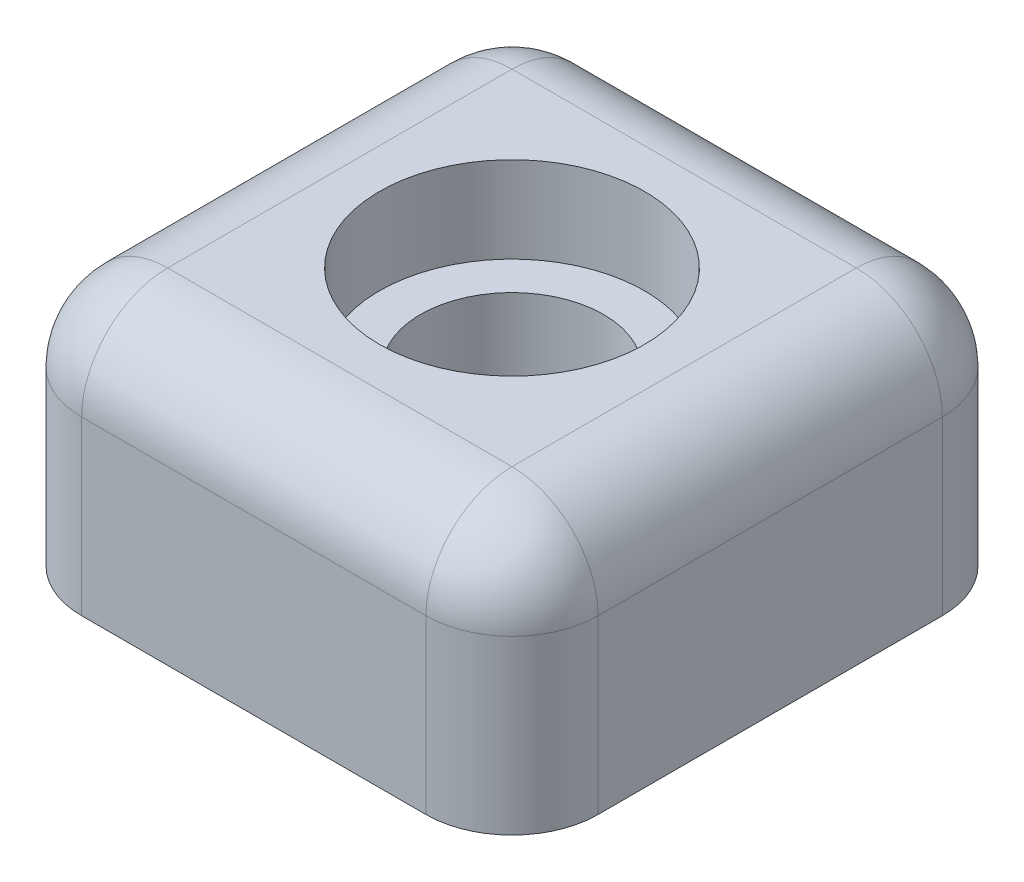
ISO-10303-21;
HEADER;
FILE_DESCRIPTION(('STEP AP214'),'2;1');
FILE_NAME('part.step','',(''),(''),'','','');
FILE_SCHEMA(('AUTOMOTIVE_DESIGN { 1 0 10303 214 1 1 1 1 }'));
ENDSEC;
DATA;
#1=APPLICATION_CONTEXT('core data for automotive mechanical design processes');
#2=APPLICATION_PROTOCOL_DEFINITION('international standard','automotive_design',2000,#1);
#3=PRODUCT_CONTEXT('',#1,'mechanical');
#4=PRODUCT('Part','Part','',(#3));
#5=PRODUCT_RELATED_PRODUCT_CATEGORY('part','',(#4));
#6=PRODUCT_DEFINITION_FORMATION('','',#4);
#7=PRODUCT_DEFINITION_CONTEXT('part definition',#1,'design');
#8=PRODUCT_DEFINITION('design','',#6,#7);
#9=PRODUCT_DEFINITION_SHAPE('','',#8);
#10=(LENGTH_UNIT() NAMED_UNIT(*) SI_UNIT(.MILLI.,.METRE.));
#11=(NAMED_UNIT(*) PLANE_ANGLE_UNIT() SI_UNIT($,.RADIAN.));
#12=(NAMED_UNIT(*) SI_UNIT($,.STERADIAN.) SOLID_ANGLE_UNIT());
#13=UNCERTAINTY_MEASURE_WITH_UNIT(LENGTH_MEASURE(1.E-05),#10,'distance_accuracy_value','');
#14=(GEOMETRIC_REPRESENTATION_CONTEXT(3) GLOBAL_UNCERTAINTY_ASSIGNED_CONTEXT((#13)) GLOBAL_UNIT_ASSIGNED_CONTEXT((#10,
#11,#12)) REPRESENTATION_CONTEXT('',''));
#15=CARTESIAN_POINT('',(0.,0.,0.));
#16=DIRECTION('',(0.,0.,1.));
#17=DIRECTION('',(1.,0.,0.));
#18=AXIS2_PLACEMENT_3D('',#15,#16,#17);
#19=CARTESIAN_POINT('',(0.,3.175,0.));
#20=DIRECTION('',(0.,-1.,0.));
#21=DIRECTION('',(0.,0.,-1.));
#22=AXIS2_PLACEMENT_3D('',#19,#20,#21);
#23=PLANE('',#22);
#24=DIRECTION('',(1.,0.,0.));
#25=VECTOR('',#24,1.);
#26=CARTESIAN_POINT('',(0.,3.175,6.35));
#27=LINE('',#26,#25);
#28=CARTESIAN_POINT('',(-6.35,3.175,6.35));
#29=VERTEX_POINT('',#28);
#30=CARTESIAN_POINT('',(6.35,3.175,6.35));
#31=VERTEX_POINT('',#30);
#32=EDGE_CURVE('E114',#29,#31,#27,.T.);
#33=ORIENTED_EDGE('',*,*,#32,.T.);
#34=DIRECTION('',(0.,0.,-1.));
#35=VECTOR('',#34,1.);
#36=CARTESIAN_POINT('',(6.35,3.175,0.));
#37=LINE('',#36,#35);
#38=CARTESIAN_POINT('',(6.35,3.175,-6.35));
#39=VERTEX_POINT('',#38);
#40=EDGE_CURVE('E151',#31,#39,#37,.T.);
#41=ORIENTED_EDGE('',*,*,#40,.T.);
#42=DIRECTION('',(-1.,0.,0.));
#43=VECTOR('',#42,1.);
#44=CARTESIAN_POINT('',(0.,3.175,-6.35));
#45=LINE('',#44,#43);
#46=CARTESIAN_POINT('',(-6.35,3.175,-6.35));
#47=VERTEX_POINT('',#46);
#48=EDGE_CURVE('E117',#39,#47,#45,.T.);
#49=ORIENTED_EDGE('',*,*,#48,.T.);
#50=DIRECTION('',(0.,0.,1.));
#51=VECTOR('',#50,1.);
#52=CARTESIAN_POINT('',(-6.35,3.175,0.));
#53=LINE('',#52,#51);
#54=EDGE_CURVE('E109',#47,#29,#53,.T.);
#55=ORIENTED_EDGE('',*,*,#54,.T.);
#56=EDGE_LOOP('',(#33,#41,#49,#55));
#57=FACE_BOUND('',#56,.T.);
#58=CARTESIAN_POINT('',(0.,3.175,0.));
#59=DIRECTION('',(0.,1.,0.));
#60=DIRECTION('',(0.,0.,1.));
#61=AXIS2_PLACEMENT_3D('',#58,#59,#60);
#62=CIRCLE('',#61,4.8895);
#63=CARTESIAN_POINT('',(0.,3.175,4.8895));
#64=VERTEX_POINT('',#63);
#65=EDGE_CURVE('E143',#64,#64,#62,.T.);
#66=ORIENTED_EDGE('',*,*,#65,.F.);
#67=EDGE_LOOP('',(#66));
#68=FACE_BOUND('',#67,.T.);
#69=ADVANCED_FACE('F33',(#57,#68),#23,.F.);
#70=CARTESIAN_POINT('',(9.525,3.175,9.525));
#71=DIRECTION('',(-1.,0.,0.));
#72=DIRECTION('',(0.,0.,1.));
#73=AXIS2_PLACEMENT_3D('',#70,#71,#72);
#74=PLANE('',#73);
#75=DIRECTION('',(0.,0.,1.));
#76=VECTOR('',#75,1.);
#77=CARTESIAN_POINT('',(9.525,-6.35,-9.525));
#78=LINE('',#77,#76);
#79=CARTESIAN_POINT('',(9.525,-6.35,-6.35));
#80=VERTEX_POINT('',#79);
#81=CARTESIAN_POINT('',(9.525,-6.35,6.34999999999999));
#82=VERTEX_POINT('',#81);
#83=EDGE_CURVE('E223',#80,#82,#78,.T.);
#84=ORIENTED_EDGE('',*,*,#83,.F.);
#85=DIRECTION('',(0.,-1.,0.));
#86=VECTOR('',#85,1.);
#87=CARTESIAN_POINT('',(9.525,3.175,-6.35));
#88=LINE('',#87,#86);
#89=CARTESIAN_POINT('',(9.525,0.,-6.35));
#90=VERTEX_POINT('',#89);
#91=EDGE_CURVE('E158',#80,#90,#88,.F.);
#92=ORIENTED_EDGE('',*,*,#91,.T.);
#93=DIRECTION('',(0.,0.,-1.));
#94=VECTOR('',#93,1.);
#95=CARTESIAN_POINT('',(9.525,0.,9.525));
#96=LINE('',#95,#94);
#97=CARTESIAN_POINT('',(9.525,0.,6.35));
#98=VERTEX_POINT('',#97);
#99=EDGE_CURVE('E155',#90,#98,#96,.F.);
#100=ORIENTED_EDGE('',*,*,#99,.T.);
#101=DIRECTION('',(0.,-1.,0.));
#102=VECTOR('',#101,1.);
#103=CARTESIAN_POINT('',(9.525,3.175,6.35));
#104=LINE('',#103,#102);
#105=EDGE_CURVE('E153',#98,#82,#104,.T.);
#106=ORIENTED_EDGE('',*,*,#105,.T.);
#107=EDGE_LOOP('',(#84,#92,#100,#106));
#108=FACE_BOUND('',#107,.T.);
#109=ADVANCED_FACE('F227',(#108),#74,.F.);
#110=CARTESIAN_POINT('',(-9.525,3.175,-9.525));
#111=DIRECTION('',(0.,0.,1.));
#112=DIRECTION('',(1.,0.,0.));
#113=AXIS2_PLACEMENT_3D('',#110,#111,#112);
#114=PLANE('',#113);
#115=DIRECTION('',(1.,0.,0.));
#116=VECTOR('',#115,1.);
#117=CARTESIAN_POINT('',(-9.525,-6.35,-9.525));
#118=LINE('',#117,#116);
#119=CARTESIAN_POINT('',(-6.35,-6.35,-9.525));
#120=VERTEX_POINT('',#119);
#121=CARTESIAN_POINT('',(6.34999999999999,-6.35,-9.525));
#122=VERTEX_POINT('',#121);
#123=EDGE_CURVE('E225',#120,#122,#118,.T.);
#124=ORIENTED_EDGE('',*,*,#123,.F.);
#125=DIRECTION('',(0.,-1.,0.));
#126=VECTOR('',#125,1.);
#127=CARTESIAN_POINT('',(-6.35,3.175,-9.525));
#128=LINE('',#127,#126);
#129=CARTESIAN_POINT('',(-6.35,0.,-9.525));
#130=VERTEX_POINT('',#129);
#131=EDGE_CURVE('E164',#120,#130,#128,.F.);
#132=ORIENTED_EDGE('',*,*,#131,.T.);
#133=DIRECTION('',(-1.,0.,0.));
#134=VECTOR('',#133,1.);
#135=CARTESIAN_POINT('',(-9.525,0.,-9.525));
#136=LINE('',#135,#134);
#137=CARTESIAN_POINT('',(6.35,0.,-9.525));
#138=VERTEX_POINT('',#137);
#139=EDGE_CURVE('E162',#130,#138,#136,.F.);
#140=ORIENTED_EDGE('',*,*,#139,.T.);
#141=DIRECTION('',(0.,-1.,0.));
#142=VECTOR('',#141,1.);
#143=CARTESIAN_POINT('',(6.35,3.175,-9.525));
#144=LINE('',#143,#142);
#145=EDGE_CURVE('E160',#138,#122,#144,.T.);
#146=ORIENTED_EDGE('',*,*,#145,.T.);
#147=EDGE_LOOP('',(#124,#132,#140,#146));
#148=FACE_BOUND('',#147,.T.);
#149=ADVANCED_FACE('F209',(#148),#114,.F.);
#150=CARTESIAN_POINT('',(-9.525,3.175,9.525));
#151=DIRECTION('',(1.,0.,0.));
#152=DIRECTION('',(0.,0.,-1.));
#153=AXIS2_PLACEMENT_3D('',#150,#151,#152);
#154=PLANE('',#153);
#155=DIRECTION('',(0.,0.,1.));
#156=VECTOR('',#155,1.);
#157=CARTESIAN_POINT('',(-9.525,0.,9.525));
#158=LINE('',#157,#156);
#159=CARTESIAN_POINT('',(-9.525,0.,6.35));
#160=VERTEX_POINT('',#159);
#161=CARTESIAN_POINT('',(-9.525,0.,-6.35));
#162=VERTEX_POINT('',#161);
#163=EDGE_CURVE('E127',#160,#162,#158,.F.);
#164=ORIENTED_EDGE('',*,*,#163,.T.);
#165=DIRECTION('',(0.,-1.,0.));
#166=VECTOR('',#165,1.);
#167=CARTESIAN_POINT('',(-9.525,3.175,-6.35));
#168=LINE('',#167,#166);
#169=CARTESIAN_POINT('',(-9.525,-6.35,-6.34999999999999));
#170=VERTEX_POINT('',#169);
#171=EDGE_CURVE('E169',#162,#170,#168,.T.);
#172=ORIENTED_EDGE('',*,*,#171,.T.);
#173=DIRECTION('',(0.,0.,-1.));
#174=VECTOR('',#173,1.);
#175=CARTESIAN_POINT('',(-9.525,-6.35,9.525));
#176=LINE('',#175,#174);
#177=CARTESIAN_POINT('',(-9.525,-6.35,6.35));
#178=VERTEX_POINT('',#177);
#179=EDGE_CURVE('E234',#178,#170,#176,.T.);
#180=ORIENTED_EDGE('',*,*,#179,.F.);
#181=DIRECTION('',(0.,-1.,0.));
#182=VECTOR('',#181,1.);
#183=CARTESIAN_POINT('',(-9.525,3.175,6.35));
#184=LINE('',#183,#182);
#185=EDGE_CURVE('E166',#178,#160,#184,.F.);
#186=ORIENTED_EDGE('',*,*,#185,.T.);
#187=EDGE_LOOP('',(#164,#172,#180,#186));
#188=FACE_BOUND('',#187,.T.);
#189=ADVANCED_FACE('F261',(#188),#154,.F.);
#190=CARTESIAN_POINT('',(-9.525,3.175,9.525));
#191=DIRECTION('',(0.,0.,-1.));
#192=DIRECTION('',(-1.,0.,0.));
#193=AXIS2_PLACEMENT_3D('',#190,#191,#192);
#194=PLANE('',#193);
#195=DIRECTION('',(-1.,0.,0.));
#196=VECTOR('',#195,1.);
#197=CARTESIAN_POINT('',(9.525,-6.35,9.525));
#198=LINE('',#197,#196);
#199=CARTESIAN_POINT('',(6.35,-6.35,9.525));
#200=VERTEX_POINT('',#199);
#201=CARTESIAN_POINT('',(-6.35,-6.35,9.525));
#202=VERTEX_POINT('',#201);
#203=EDGE_CURVE('E229',#200,#202,#198,.T.);
#204=ORIENTED_EDGE('',*,*,#203,.F.);
#205=DIRECTION('',(0.,-1.,0.));
#206=VECTOR('',#205,1.);
#207=CARTESIAN_POINT('',(6.35,3.175,9.525));
#208=LINE('',#207,#206);
#209=CARTESIAN_POINT('',(6.35,0.,9.525));
#210=VERTEX_POINT('',#209);
#211=EDGE_CURVE('E50',#200,#210,#208,.F.);
#212=ORIENTED_EDGE('',*,*,#211,.T.);
#213=DIRECTION('',(1.,0.,0.));
#214=VECTOR('',#213,1.);
#215=CARTESIAN_POINT('',(-9.525,0.,9.525));
#216=LINE('',#215,#214);
#217=CARTESIAN_POINT('',(-6.35,0.,9.525));
#218=VERTEX_POINT('',#217);
#219=EDGE_CURVE('E54',#210,#218,#216,.F.);
#220=ORIENTED_EDGE('',*,*,#219,.T.);
#221=DIRECTION('',(0.,-1.,0.));
#222=VECTOR('',#221,1.);
#223=CARTESIAN_POINT('',(-6.35,3.175,9.525));
#224=LINE('',#223,#222);
#225=EDGE_CURVE('E171',#218,#202,#224,.T.);
#226=ORIENTED_EDGE('',*,*,#225,.T.);
#227=EDGE_LOOP('',(#204,#212,#220,#226));
#228=FACE_BOUND('',#227,.T.);
#229=ADVANCED_FACE('F251',(#228),#194,.F.);
#230=CARTESIAN_POINT('',(0.,3.175,0.));
#231=DIRECTION('',(0.,-1.,0.));
#232=DIRECTION('',(0.,0.,-1.));
#233=AXIS2_PLACEMENT_3D('',#230,#231,#232);
#234=CYLINDRICAL_SURFACE('',#233,4.8895);
#235=ORIENTED_EDGE('',*,*,#65,.T.);
#236=EDGE_LOOP('',(#235));
#237=FACE_BOUND('',#236,.T.);
#238=CARTESIAN_POINT('',(0.,0.,0.));
#239=DIRECTION('',(0.,1.,0.));
#240=DIRECTION('',(0.,0.,1.));
#241=AXIS2_PLACEMENT_3D('',#238,#239,#240);
#242=CIRCLE('',#241,4.8895);
#243=CARTESIAN_POINT('',(0.,0.,4.8895));
#244=VERTEX_POINT('',#243);
#245=EDGE_CURVE('E146',#244,#244,#242,.T.);
#246=ORIENTED_EDGE('',*,*,#245,.F.);
#247=EDGE_LOOP('',(#246));
#248=FACE_BOUND('',#247,.T.);
#249=ADVANCED_FACE('F249',(#237,#248),#234,.F.);
#250=CARTESIAN_POINT('',(0.,0.,0.));
#251=DIRECTION('',(0.,-1.,0.));
#252=DIRECTION('',(0.,0.,-1.));
#253=AXIS2_PLACEMENT_3D('',#250,#251,#252);
#254=PLANE('',#253);
#255=CARTESIAN_POINT('',(0.,0.,0.));
#256=DIRECTION('',(0.,-1.,0.));
#257=DIRECTION('',(0.,0.,-1.));
#258=AXIS2_PLACEMENT_3D('',#255,#256,#257);
#259=CIRCLE('',#258,3.3782);
#260=CARTESIAN_POINT('',(0.,0.,-3.3782));
#261=VERTEX_POINT('',#260);
#262=EDGE_CURVE('E240',#261,#261,#259,.T.);
#263=ORIENTED_EDGE('',*,*,#262,.T.);
#264=EDGE_LOOP('',(#263));
#265=FACE_BOUND('',#264,.T.);
#266=ORIENTED_EDGE('',*,*,#245,.T.);
#267=EDGE_LOOP('',(#266));
#268=FACE_BOUND('',#267,.T.);
#269=ADVANCED_FACE('F247',(#265,#268),#254,.F.);
#270=CARTESIAN_POINT('',(0.,-3.175,0.));
#271=DIRECTION('',(0.,1.,0.));
#272=DIRECTION('',(0.,0.,1.));
#273=AXIS2_PLACEMENT_3D('',#270,#271,#272);
#274=CYLINDRICAL_SURFACE('',#273,3.3782);
#275=CARTESIAN_POINT('',(0.,-3.175,0.));
#276=DIRECTION('',(0.,-1.,0.));
#277=DIRECTION('',(0.,0.,-1.));
#278=AXIS2_PLACEMENT_3D('',#275,#276,#277);
#279=CIRCLE('',#278,3.3782);
#280=CARTESIAN_POINT('',(0.,-3.175,-3.3782));
#281=VERTEX_POINT('',#280);
#282=EDGE_CURVE('E232',#281,#281,#279,.T.);
#283=ORIENTED_EDGE('',*,*,#282,.T.);
#284=EDGE_LOOP('',(#283));
#285=FACE_BOUND('',#284,.T.);
#286=ORIENTED_EDGE('',*,*,#262,.F.);
#287=EDGE_LOOP('',(#286));
#288=FACE_BOUND('',#287,.T.);
#289=ADVANCED_FACE('F258',(#285,#288),#274,.F.);
#290=CARTESIAN_POINT('',(0.,-3.175,0.));
#291=DIRECTION('',(0.,-1.,0.));
#292=DIRECTION('',(0.,0.,-1.));
#293=AXIS2_PLACEMENT_3D('',#290,#291,#292);
#294=PLANE('',#293);
#295=ORIENTED_EDGE('',*,*,#282,.F.);
#296=EDGE_LOOP('',(#295));
#297=FACE_BOUND('',#296,.T.);
#298=ADVANCED_FACE('F314',(#297),#294,.F.);
#299=CARTESIAN_POINT('',(0.,-6.35,0.));
#300=DIRECTION('',(0.,-1.,0.));
#301=DIRECTION('',(0.,0.,-1.));
#302=AXIS2_PLACEMENT_3D('',#299,#300,#301);
#303=PLANE('',#302);
#304=ORIENTED_EDGE('',*,*,#179,.T.);
#305=CARTESIAN_POINT('',(-6.35,-6.35,-6.35));
#306=DIRECTION('',(0.,-1.,0.));
#307=DIRECTION('',(0.,0.,-1.));
#308=AXIS2_PLACEMENT_3D('',#305,#306,#307);
#309=CIRCLE('',#308,3.175);
#310=EDGE_CURVE('E11',#170,#120,#309,.T.);
#311=ORIENTED_EDGE('',*,*,#310,.T.);
#312=ORIENTED_EDGE('',*,*,#123,.T.);
#313=CARTESIAN_POINT('',(6.35,-6.35,-6.35));
#314=DIRECTION('',(0.,-1.,0.));
#315=DIRECTION('',(0.,0.,-1.));
#316=AXIS2_PLACEMENT_3D('',#313,#314,#315);
#317=CIRCLE('',#316,3.175);
#318=EDGE_CURVE('E42',#122,#80,#317,.T.);
#319=ORIENTED_EDGE('',*,*,#318,.T.);
#320=ORIENTED_EDGE('',*,*,#83,.T.);
#321=CARTESIAN_POINT('',(6.35,-6.35,6.35));
#322=DIRECTION('',(0.,-1.,0.));
#323=DIRECTION('',(0.,0.,-1.));
#324=AXIS2_PLACEMENT_3D('',#321,#322,#323);
#325=CIRCLE('',#324,3.175);
#326=EDGE_CURVE('E177',#82,#200,#325,.T.);
#327=ORIENTED_EDGE('',*,*,#326,.T.);
#328=ORIENTED_EDGE('',*,*,#203,.T.);
#329=CARTESIAN_POINT('',(-6.35,-6.35,6.35));
#330=DIRECTION('',(0.,-1.,0.));
#331=DIRECTION('',(0.,0.,-1.));
#332=AXIS2_PLACEMENT_3D('',#329,#330,#331);
#333=CIRCLE('',#332,3.175);
#334=EDGE_CURVE('E175',#202,#178,#333,.T.);
#335=ORIENTED_EDGE('',*,*,#334,.T.);
#336=EDGE_LOOP('',(#304,#311,#312,#319,#320,#327,#328,#335));
#337=FACE_BOUND('',#336,.T.);
#338=ADVANCED_FACE('F222',(#337),#303,.T.);
#339=CARTESIAN_POINT('',(-6.35,3.175,6.35));
#340=DIRECTION('',(0.,-1.,0.));
#341=DIRECTION('',(0.,0.,-1.));
#342=AXIS2_PLACEMENT_3D('',#339,#340,#341);
#343=CYLINDRICAL_SURFACE('',#342,3.175);
#344=ORIENTED_EDGE('',*,*,#334,.F.);
#345=ORIENTED_EDGE('',*,*,#225,.F.);
#346=CARTESIAN_POINT('',(-6.35,0.,6.35));
#347=DIRECTION('',(0.,1.,0.));
#348=DIRECTION('',(0.,0.,1.));
#349=AXIS2_PLACEMENT_3D('',#346,#347,#348);
#350=CIRCLE('',#349,3.175);
#351=EDGE_CURVE('E37',#160,#218,#350,.T.);
#352=ORIENTED_EDGE('',*,*,#351,.F.);
#353=ORIENTED_EDGE('',*,*,#185,.F.);
#354=EDGE_LOOP('',(#344,#345,#352,#353));
#355=FACE_BOUND('',#354,.T.);
#356=ADVANCED_FACE('F35',(#355),#343,.T.);
#357=CARTESIAN_POINT('',(-6.35,0.,0.));
#358=DIRECTION('',(0.,0.,1.));
#359=DIRECTION('',(1.,0.,0.));
#360=AXIS2_PLACEMENT_3D('',#357,#358,#359);
#361=CYLINDRICAL_SURFACE('',#360,3.175);
#362=CARTESIAN_POINT('',(-6.35,0.,-6.35));
#363=DIRECTION('',(0.,0.,-1.));
#364=DIRECTION('',(0.,1.,0.));
#365=AXIS2_PLACEMENT_3D('',#362,#363,#364);
#366=CIRCLE('',#365,3.175);
#367=EDGE_CURVE('E131',#162,#47,#366,.T.);
#368=ORIENTED_EDGE('',*,*,#367,.F.);
#369=ORIENTED_EDGE('',*,*,#163,.F.);
#370=CARTESIAN_POINT('',(-6.35,0.,6.35));
#371=DIRECTION('',(0.,0.,1.));
#372=DIRECTION('',(1.,0.,0.));
#373=AXIS2_PLACEMENT_3D('',#370,#371,#372);
#374=CIRCLE('',#373,3.175);
#375=EDGE_CURVE('E124',#29,#160,#374,.T.);
#376=ORIENTED_EDGE('',*,*,#375,.F.);
#377=ORIENTED_EDGE('',*,*,#54,.F.);
#378=EDGE_LOOP('',(#368,#369,#376,#377));
#379=FACE_BOUND('',#378,.T.);
#380=ADVANCED_FACE('F126',(#379),#361,.T.);
#381=CARTESIAN_POINT('',(-6.35,3.175,-6.35));
#382=DIRECTION('',(0.,-1.,0.));
#383=DIRECTION('',(0.,0.,-1.));
#384=AXIS2_PLACEMENT_3D('',#381,#382,#383);
#385=CYLINDRICAL_SURFACE('',#384,3.175);
#386=ORIENTED_EDGE('',*,*,#310,.F.);
#387=ORIENTED_EDGE('',*,*,#171,.F.);
#388=CARTESIAN_POINT('',(-6.35,0.,-6.35));
#389=DIRECTION('',(0.,1.,0.));
#390=DIRECTION('',(0.,0.,1.));
#391=AXIS2_PLACEMENT_3D('',#388,#389,#390);
#392=CIRCLE('',#391,3.175);
#393=EDGE_CURVE('E136',#130,#162,#392,.T.);
#394=ORIENTED_EDGE('',*,*,#393,.F.);
#395=ORIENTED_EDGE('',*,*,#131,.F.);
#396=EDGE_LOOP('',(#386,#387,#394,#395));
#397=FACE_BOUND('',#396,.T.);
#398=ADVANCED_FACE('F302',(#397),#385,.T.);
#399=CARTESIAN_POINT('',(-6.35,0.,6.35));
#400=DIRECTION('',(0.,0.,1.));
#401=DIRECTION('',(1.,0.,0.));
#402=AXIS2_PLACEMENT_3D('',#399,#400,#401);
#403=SPHERICAL_SURFACE('',#402,3.175);
#404=ORIENTED_EDGE('',*,*,#375,.T.);
#405=ORIENTED_EDGE('',*,*,#351,.T.);
#406=CARTESIAN_POINT('',(-6.35,0.,6.35));
#407=DIRECTION('',(-1.,0.,0.));
#408=DIRECTION('',(0.,0.,1.));
#409=AXIS2_PLACEMENT_3D('',#406,#407,#408);
#410=CIRCLE('',#409,3.175);
#411=EDGE_CURVE('E133',#29,#218,#410,.F.);
#412=ORIENTED_EDGE('',*,*,#411,.F.);
#413=EDGE_LOOP('',(#404,#405,#412));
#414=FACE_BOUND('',#413,.T.);
#415=ADVANCED_FACE('F134',(#414),#403,.T.);
#416=CARTESIAN_POINT('',(-6.35,0.,-6.35));
#417=DIRECTION('',(0.,0.,1.));
#418=DIRECTION('',(1.,0.,0.));
#419=AXIS2_PLACEMENT_3D('',#416,#417,#418);
#420=SPHERICAL_SURFACE('',#419,3.175);
#421=ORIENTED_EDGE('',*,*,#393,.T.);
#422=ORIENTED_EDGE('',*,*,#367,.T.);
#423=CARTESIAN_POINT('',(-6.35,0.,-6.35));
#424=DIRECTION('',(-1.,0.,0.));
#425=DIRECTION('',(0.,0.,1.));
#426=AXIS2_PLACEMENT_3D('',#423,#424,#425);
#427=CIRCLE('',#426,3.175);
#428=EDGE_CURVE('E137',#130,#47,#427,.F.);
#429=ORIENTED_EDGE('',*,*,#428,.F.);
#430=EDGE_LOOP('',(#421,#422,#429));
#431=FACE_BOUND('',#430,.T.);
#432=ADVANCED_FACE('F200',(#431),#420,.T.);
#433=CARTESIAN_POINT('',(6.35,3.175,6.35));
#434=DIRECTION('',(0.,-1.,0.));
#435=DIRECTION('',(0.,0.,-1.));
#436=AXIS2_PLACEMENT_3D('',#433,#434,#435);
#437=CYLINDRICAL_SURFACE('',#436,3.175);
#438=ORIENTED_EDGE('',*,*,#326,.F.);
#439=ORIENTED_EDGE('',*,*,#105,.F.);
#440=CARTESIAN_POINT('',(6.35,0.,6.35));
#441=DIRECTION('',(0.,1.,0.));
#442=DIRECTION('',(0.,0.,1.));
#443=AXIS2_PLACEMENT_3D('',#440,#441,#442);
#444=CIRCLE('',#443,3.175);
#445=EDGE_CURVE('E191',#210,#98,#444,.T.);
#446=ORIENTED_EDGE('',*,*,#445,.F.);
#447=ORIENTED_EDGE('',*,*,#211,.F.);
#448=EDGE_LOOP('',(#438,#439,#446,#447));
#449=FACE_BOUND('',#448,.T.);
#450=ADVANCED_FACE('F294',(#449),#437,.T.);
#451=CARTESIAN_POINT('',(0.,0.,6.35));
#452=DIRECTION('',(1.,0.,0.));
#453=DIRECTION('',(0.,0.,-1.));
#454=AXIS2_PLACEMENT_3D('',#451,#452,#453);
#455=CYLINDRICAL_SURFACE('',#454,3.175);
#456=ORIENTED_EDGE('',*,*,#411,.T.);
#457=ORIENTED_EDGE('',*,*,#219,.F.);
#458=CARTESIAN_POINT('',(6.35,0.,6.35));
#459=DIRECTION('',(1.,0.,0.));
#460=DIRECTION('',(0.,0.,-1.));
#461=AXIS2_PLACEMENT_3D('',#458,#459,#460);
#462=CIRCLE('',#461,3.175);
#463=EDGE_CURVE('E141',#31,#210,#462,.T.);
#464=ORIENTED_EDGE('',*,*,#463,.F.);
#465=ORIENTED_EDGE('',*,*,#32,.F.);
#466=EDGE_LOOP('',(#456,#457,#464,#465));
#467=FACE_BOUND('',#466,.T.);
#468=ADVANCED_FACE('F139',(#467),#455,.T.);
#469=CARTESIAN_POINT('',(0.,0.,-6.35));
#470=DIRECTION('',(-1.,0.,0.));
#471=DIRECTION('',(0.,0.,1.));
#472=AXIS2_PLACEMENT_3D('',#469,#470,#471);
#473=CYLINDRICAL_SURFACE('',#472,3.175);
#474=ORIENTED_EDGE('',*,*,#428,.T.);
#475=ORIENTED_EDGE('',*,*,#48,.F.);
#476=CARTESIAN_POINT('',(6.35,0.,-6.35));
#477=DIRECTION('',(1.,0.,0.));
#478=DIRECTION('',(0.,1.,0.));
#479=AXIS2_PLACEMENT_3D('',#476,#477,#478);
#480=CIRCLE('',#479,3.175);
#481=EDGE_CURVE('E187',#138,#39,#480,.T.);
#482=ORIENTED_EDGE('',*,*,#481,.F.);
#483=ORIENTED_EDGE('',*,*,#139,.F.);
#484=EDGE_LOOP('',(#474,#475,#482,#483));
#485=FACE_BOUND('',#484,.T.);
#486=ADVANCED_FACE('F204',(#485),#473,.T.);
#487=CARTESIAN_POINT('',(6.35,3.175,-6.35));
#488=DIRECTION('',(0.,-1.,0.));
#489=DIRECTION('',(0.,0.,-1.));
#490=AXIS2_PLACEMENT_3D('',#487,#488,#489);
#491=CYLINDRICAL_SURFACE('',#490,3.175);
#492=ORIENTED_EDGE('',*,*,#318,.F.);
#493=ORIENTED_EDGE('',*,*,#145,.F.);
#494=CARTESIAN_POINT('',(6.35,0.,-6.35));
#495=DIRECTION('',(0.,1.,0.));
#496=DIRECTION('',(0.,0.,1.));
#497=AXIS2_PLACEMENT_3D('',#494,#495,#496);
#498=CIRCLE('',#497,3.175);
#499=EDGE_CURVE('E184',#90,#138,#498,.T.);
#500=ORIENTED_EDGE('',*,*,#499,.F.);
#501=ORIENTED_EDGE('',*,*,#91,.F.);
#502=EDGE_LOOP('',(#492,#493,#500,#501));
#503=FACE_BOUND('',#502,.T.);
#504=ADVANCED_FACE('F215',(#503),#491,.T.);
#505=CARTESIAN_POINT('',(6.35,0.,6.35));
#506=DIRECTION('',(0.,0.,1.));
#507=DIRECTION('',(1.,0.,0.));
#508=AXIS2_PLACEMENT_3D('',#505,#506,#507);
#509=SPHERICAL_SURFACE('',#508,3.175);
#510=ORIENTED_EDGE('',*,*,#463,.T.);
#511=ORIENTED_EDGE('',*,*,#445,.T.);
#512=CARTESIAN_POINT('',(6.35,0.,6.35));
#513=DIRECTION('',(0.,0.,1.));
#514=DIRECTION('',(1.,0.,0.));
#515=AXIS2_PLACEMENT_3D('',#512,#513,#514);
#516=CIRCLE('',#515,3.175);
#517=EDGE_CURVE('E182',#31,#98,#516,.F.);
#518=ORIENTED_EDGE('',*,*,#517,.F.);
#519=EDGE_LOOP('',(#510,#511,#518));
#520=FACE_BOUND('',#519,.T.);
#521=ADVANCED_FACE('F283',(#520),#509,.T.);
#522=CARTESIAN_POINT('',(6.35,0.,-6.35));
#523=DIRECTION('',(0.,0.,1.));
#524=DIRECTION('',(1.,0.,0.));
#525=AXIS2_PLACEMENT_3D('',#522,#523,#524);
#526=SPHERICAL_SURFACE('',#525,3.175);
#527=ORIENTED_EDGE('',*,*,#499,.T.);
#528=ORIENTED_EDGE('',*,*,#481,.T.);
#529=CARTESIAN_POINT('',(6.35,0.,-6.35));
#530=DIRECTION('',(0.,0.,-1.));
#531=DIRECTION('',(-1.,0.,0.));
#532=AXIS2_PLACEMENT_3D('',#529,#530,#531);
#533=CIRCLE('',#532,3.175);
#534=EDGE_CURVE('E180',#90,#39,#533,.F.);
#535=ORIENTED_EDGE('',*,*,#534,.F.);
#536=EDGE_LOOP('',(#527,#528,#535));
#537=FACE_BOUND('',#536,.T.);
#538=ADVANCED_FACE('F279',(#537),#526,.T.);
#539=CARTESIAN_POINT('',(6.35,0.,0.));
#540=DIRECTION('',(0.,0.,-1.));
#541=DIRECTION('',(-1.,0.,0.));
#542=AXIS2_PLACEMENT_3D('',#539,#540,#541);
#543=CYLINDRICAL_SURFACE('',#542,3.175);
#544=ORIENTED_EDGE('',*,*,#517,.T.);
#545=ORIENTED_EDGE('',*,*,#99,.F.);
#546=ORIENTED_EDGE('',*,*,#534,.T.);
#547=ORIENTED_EDGE('',*,*,#40,.F.);
#548=EDGE_LOOP('',(#544,#545,#546,#547));
#549=FACE_BOUND('',#548,.T.);
#550=ADVANCED_FACE('F276',(#549),#543,.T.);
#551=CLOSED_SHELL('',(#69,#109,#149,#189,#229,#249,#269,#289,#298,#338,#356,#380,#398,#415,#432,
#450,#468,#486,#504,#521,#538,#550));
#552=MANIFOLD_SOLID_BREP('B2',#551);
#553=ADVANCED_BREP_SHAPE_REPRESENTATION('',(#18,#552),#14);
#554=SHAPE_DEFINITION_REPRESENTATION(#9,#553);
ENDSEC;
END-ISO-10303-21;
